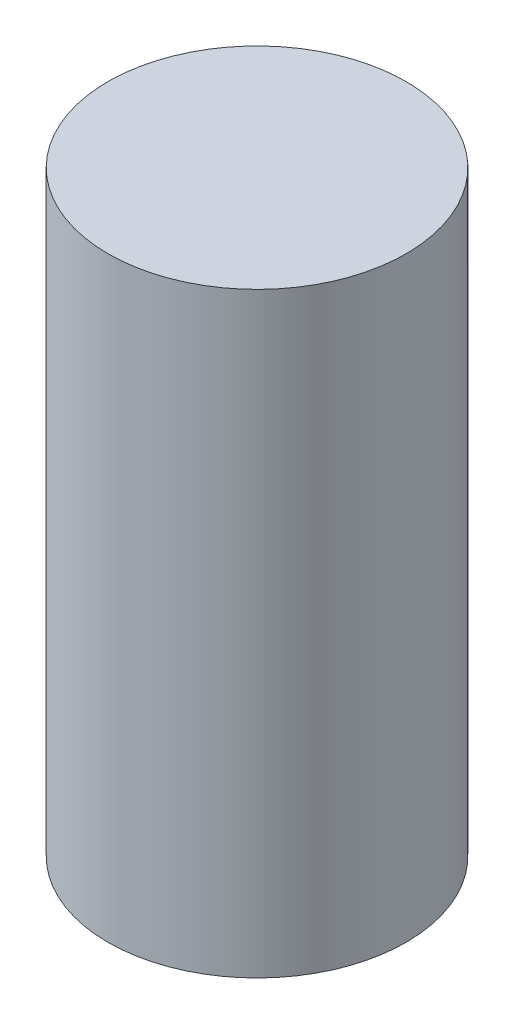
ISO-10303-21;
HEADER;
FILE_DESCRIPTION(('STEP AP214'),'2;1');
FILE_NAME('part.step','',(''),(''),'','','');
FILE_SCHEMA(('AUTOMOTIVE_DESIGN { 1 0 10303 214 1 1 1 1 }'));
ENDSEC;
DATA;
#1=APPLICATION_CONTEXT('core data for automotive mechanical design processes');
#2=APPLICATION_PROTOCOL_DEFINITION('international standard','automotive_design',2000,#1);
#3=PRODUCT_CONTEXT('',#1,'mechanical');
#4=PRODUCT('Part','Part','',(#3));
#5=PRODUCT_RELATED_PRODUCT_CATEGORY('part','',(#4));
#6=PRODUCT_DEFINITION_FORMATION('','',#4);
#7=PRODUCT_DEFINITION_CONTEXT('part definition',#1,'design');
#8=PRODUCT_DEFINITION('design','',#6,#7);
#9=PRODUCT_DEFINITION_SHAPE('','',#8);
#10=(LENGTH_UNIT() NAMED_UNIT(*) SI_UNIT(.MILLI.,.METRE.));
#11=(NAMED_UNIT(*) PLANE_ANGLE_UNIT() SI_UNIT($,.RADIAN.));
#12=(NAMED_UNIT(*) SI_UNIT($,.STERADIAN.) SOLID_ANGLE_UNIT());
#13=UNCERTAINTY_MEASURE_WITH_UNIT(LENGTH_MEASURE(1.E-05),#10,'distance_accuracy_value','');
#14=(GEOMETRIC_REPRESENTATION_CONTEXT(3) GLOBAL_UNCERTAINTY_ASSIGNED_CONTEXT((#13)) GLOBAL_UNIT_ASSIGNED_CONTEXT((#10,
#11,#12)) REPRESENTATION_CONTEXT('',''));
#15=CARTESIAN_POINT('',(0.,0.,0.));
#16=DIRECTION('',(0.,0.,1.));
#17=DIRECTION('',(1.,0.,0.));
#18=AXIS2_PLACEMENT_3D('',#15,#16,#17);
#19=CARTESIAN_POINT('',(0.,50.,0.));
#20=DIRECTION('',(0.,-1.,0.));
#21=DIRECTION('',(0.,0.,-1.));
#22=AXIS2_PLACEMENT_3D('',#19,#20,#21);
#23=CYLINDRICAL_SURFACE('',#22,12.5);
#24=CARTESIAN_POINT('',(0.,50.,0.));
#25=DIRECTION('',(0.,1.,0.));
#26=DIRECTION('',(0.,0.,1.));
#27=AXIS2_PLACEMENT_3D('',#24,#25,#26);
#28=CIRCLE('',#27,12.5);
#29=CARTESIAN_POINT('',(0.,50.,12.5));
#30=VERTEX_POINT('',#29);
#31=EDGE_CURVE('E10',#30,#30,#28,.T.);
#32=ORIENTED_EDGE('',*,*,#31,.F.);
#33=EDGE_LOOP('',(#32));
#34=FACE_BOUND('',#33,.T.);
#35=CARTESIAN_POINT('',(0.,0.,0.));
#36=DIRECTION('',(0.,1.,0.));
#37=DIRECTION('',(0.,0.,1.));
#38=AXIS2_PLACEMENT_3D('',#35,#36,#37);
#39=CIRCLE('',#38,12.5);
#40=CARTESIAN_POINT('',(0.,0.,12.5));
#41=VERTEX_POINT('',#40);
#42=EDGE_CURVE('E34',#41,#41,#39,.T.);
#43=ORIENTED_EDGE('',*,*,#42,.T.);
#44=EDGE_LOOP('',(#43));
#45=FACE_BOUND('',#44,.T.);
#46=ADVANCED_FACE('F31',(#34,#45),#23,.T.);
#47=CARTESIAN_POINT('',(0.,50.,0.));
#48=DIRECTION('',(0.,1.,0.));
#49=DIRECTION('',(0.,0.,1.));
#50=AXIS2_PLACEMENT_3D('',#47,#48,#49);
#51=PLANE('',#50);
#52=ORIENTED_EDGE('',*,*,#31,.T.);
#53=EDGE_LOOP('',(#52));
#54=FACE_BOUND('',#53,.T.);
#55=ADVANCED_FACE('F46',(#54),#51,.T.);
#56=CARTESIAN_POINT('',(0.,0.,0.));
#57=DIRECTION('',(0.,1.,0.));
#58=DIRECTION('',(0.,0.,1.));
#59=AXIS2_PLACEMENT_3D('',#56,#57,#58);
#60=PLANE('',#59);
#61=ORIENTED_EDGE('',*,*,#42,.F.);
#62=EDGE_LOOP('',(#61));
#63=FACE_BOUND('',#62,.T.);
#64=ADVANCED_FACE('F44',(#63),#60,.F.);
#65=CLOSED_SHELL('',(#46,#55,#64));
#66=MANIFOLD_SOLID_BREP('B2',#65);
#67=ADVANCED_BREP_SHAPE_REPRESENTATION('',(#18,#66),#14);
#68=SHAPE_DEFINITION_REPRESENTATION(#9,#67);
ENDSEC;
END-ISO-10303-21;
